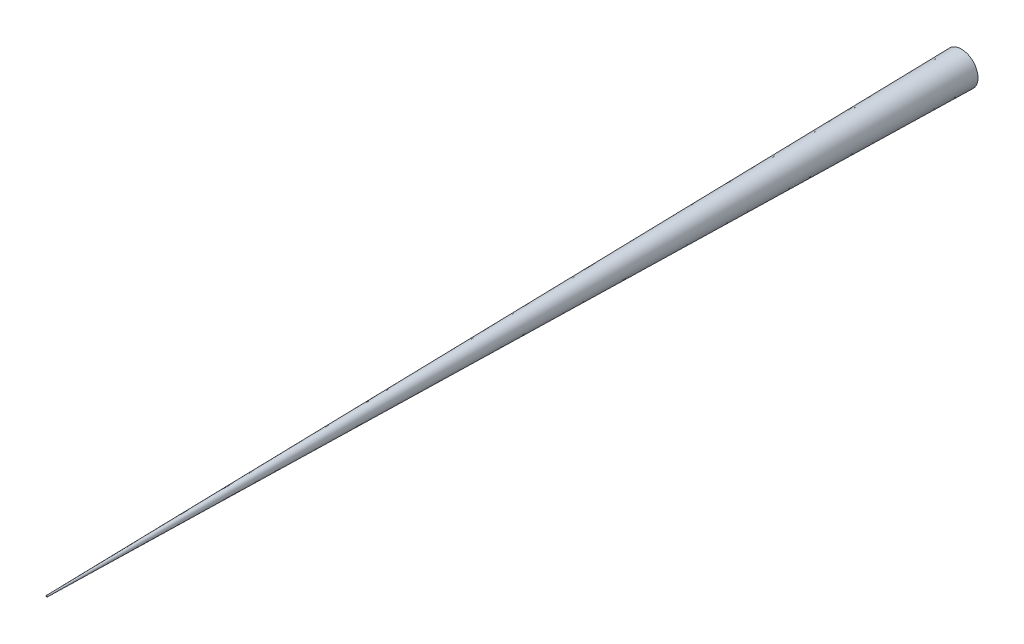
ISO-10303-21;
HEADER;
FILE_DESCRIPTION(('STEP AP214'),'2;1');
FILE_NAME('part.step','',(''),(''),'','','');
FILE_SCHEMA(('AUTOMOTIVE_DESIGN { 1 0 10303 214 1 1 1 1 }'));
ENDSEC;
DATA;
#1=APPLICATION_CONTEXT('core data for automotive mechanical design processes');
#2=APPLICATION_PROTOCOL_DEFINITION('international standard','automotive_design',2000,#1);
#3=PRODUCT_CONTEXT('',#1,'mechanical');
#4=PRODUCT('Part','Part','',(#3));
#5=PRODUCT_RELATED_PRODUCT_CATEGORY('part','',(#4));
#6=PRODUCT_DEFINITION_FORMATION('','',#4);
#7=PRODUCT_DEFINITION_CONTEXT('part definition',#1,'design');
#8=PRODUCT_DEFINITION('design','',#6,#7);
#9=PRODUCT_DEFINITION_SHAPE('','',#8);
#10=(LENGTH_UNIT() NAMED_UNIT(*) SI_UNIT(.MILLI.,.METRE.));
#11=(NAMED_UNIT(*) PLANE_ANGLE_UNIT() SI_UNIT($,.RADIAN.));
#12=(NAMED_UNIT(*) SI_UNIT($,.STERADIAN.) SOLID_ANGLE_UNIT());
#13=UNCERTAINTY_MEASURE_WITH_UNIT(LENGTH_MEASURE(1.E-05),#10,'distance_accuracy_value','');
#14=(GEOMETRIC_REPRESENTATION_CONTEXT(3) GLOBAL_UNCERTAINTY_ASSIGNED_CONTEXT((#13)) GLOBAL_UNIT_ASSIGNED_CONTEXT((#10,
#11,#12)) REPRESENTATION_CONTEXT('',''));
#15=CARTESIAN_POINT('',(0.,0.,0.));
#16=DIRECTION('',(0.,0.,1.));
#17=DIRECTION('',(1.,0.,0.));
#18=AXIS2_PLACEMENT_3D('',#15,#16,#17);
#19=CARTESIAN_POINT('',(0.,0.,0.));
#20=DIRECTION('',(0.,0.,-1.));
#21=DIRECTION('',(1.,0.,0.));
#22=AXIS2_PLACEMENT_3D('',#19,#20,#21);
#23=CONICAL_SURFACE('',#22,12.7,0.0174532925199433);
#24=CARTESIAN_POINT('',(0.,0.,700.));
#25=DIRECTION('',(0.,0.,1.));
#26=DIRECTION('',(1.,0.,0.));
#27=AXIS2_PLACEMENT_3D('',#24,#25,#26);
#28=CIRCLE('',#27,0.481454550247664);
#29=CARTESIAN_POINT('',(0.481454550247664,0.,700.));
#30=VERTEX_POINT('',#29);
#31=EDGE_CURVE('E10',#30,#30,#28,.T.);
#32=ORIENTED_EDGE('',*,*,#31,.F.);
#33=EDGE_LOOP('',(#32));
#34=FACE_BOUND('',#33,.T.);
#35=CARTESIAN_POINT('',(0.,0.,0.));
#36=DIRECTION('',(0.,0.,1.));
#37=DIRECTION('',(1.,0.,0.));
#38=AXIS2_PLACEMENT_3D('',#35,#36,#37);
#39=CIRCLE('',#38,12.7);
#40=CARTESIAN_POINT('',(12.7,0.,0.));
#41=VERTEX_POINT('',#40);
#42=EDGE_CURVE('E37',#41,#41,#39,.T.);
#43=ORIENTED_EDGE('',*,*,#42,.T.);
#44=EDGE_LOOP('',(#43));
#45=FACE_BOUND('',#44,.T.);
#46=ADVANCED_FACE('F31',(#34,#45),#23,.T.);
#47=CARTESIAN_POINT('',(0.,0.,700.));
#48=DIRECTION('',(0.,0.,1.));
#49=DIRECTION('',(1.,0.,0.));
#50=AXIS2_PLACEMENT_3D('',#47,#48,#49);
#51=PLANE('',#50);
#52=ORIENTED_EDGE('',*,*,#31,.T.);
#53=EDGE_LOOP('',(#52));
#54=FACE_BOUND('',#53,.T.);
#55=ADVANCED_FACE('F46',(#54),#51,.T.);
#56=CARTESIAN_POINT('',(0.,0.,0.));
#57=DIRECTION('',(0.,0.,1.));
#58=DIRECTION('',(1.,0.,0.));
#59=AXIS2_PLACEMENT_3D('',#56,#57,#58);
#60=PLANE('',#59);
#61=ORIENTED_EDGE('',*,*,#42,.F.);
#62=EDGE_LOOP('',(#61));
#63=FACE_BOUND('',#62,.T.);
#64=ADVANCED_FACE('F44',(#63),#60,.F.);
#65=CLOSED_SHELL('',(#46,#55,#64));
#66=MANIFOLD_SOLID_BREP('B2',#65);
#67=ADVANCED_BREP_SHAPE_REPRESENTATION('',(#18,#66),#14);
#68=SHAPE_DEFINITION_REPRESENTATION(#9,#67);
ENDSEC;
END-ISO-10303-21;
